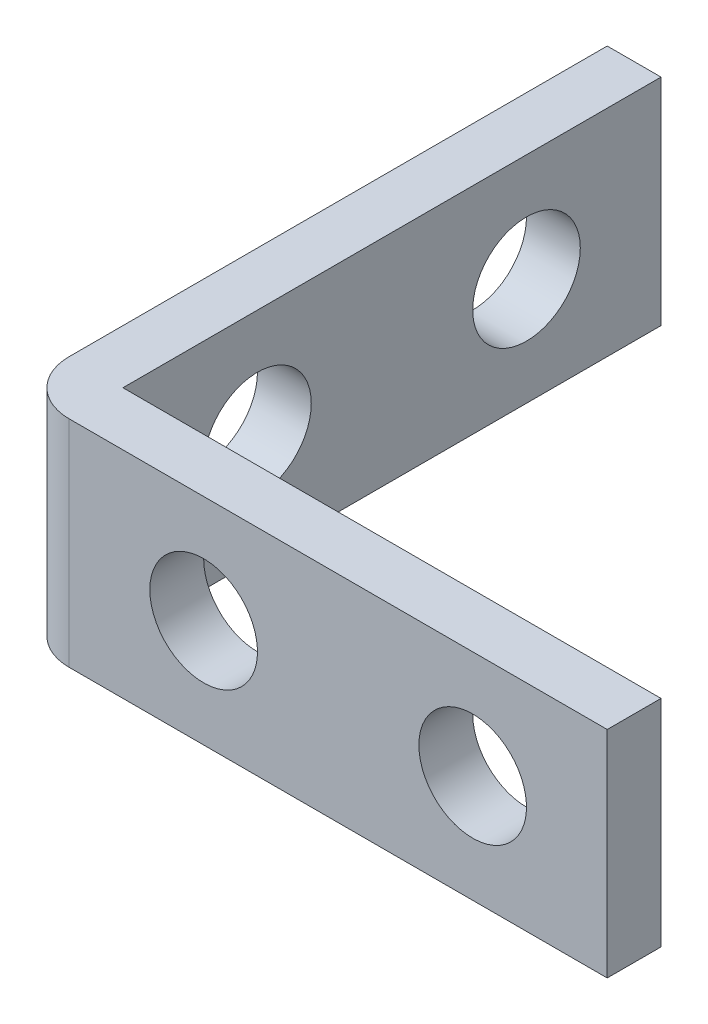
ISO-10303-21;
HEADER;
FILE_DESCRIPTION(('STEP AP214'),'2;1');
FILE_NAME('part.step','',(''),(''),'','','');
FILE_SCHEMA(('AUTOMOTIVE_DESIGN { 1 0 10303 214 1 1 1 1 }'));
ENDSEC;
DATA;
#1=APPLICATION_CONTEXT('core data for automotive mechanical design processes');
#2=APPLICATION_PROTOCOL_DEFINITION('international standard','automotive_design',2000,#1);
#3=PRODUCT_CONTEXT('',#1,'mechanical');
#4=PRODUCT('Part','Part','',(#3));
#5=PRODUCT_RELATED_PRODUCT_CATEGORY('part','',(#4));
#6=PRODUCT_DEFINITION_FORMATION('','',#4);
#7=PRODUCT_DEFINITION_CONTEXT('part definition',#1,'design');
#8=PRODUCT_DEFINITION('design','',#6,#7);
#9=PRODUCT_DEFINITION_SHAPE('','',#8);
#10=(LENGTH_UNIT() NAMED_UNIT(*) SI_UNIT(.MILLI.,.METRE.));
#11=(NAMED_UNIT(*) PLANE_ANGLE_UNIT() SI_UNIT($,.RADIAN.));
#12=(NAMED_UNIT(*) SI_UNIT($,.STERADIAN.) SOLID_ANGLE_UNIT());
#13=UNCERTAINTY_MEASURE_WITH_UNIT(LENGTH_MEASURE(1.E-05),#10,'distance_accuracy_value','');
#14=(GEOMETRIC_REPRESENTATION_CONTEXT(3) GLOBAL_UNCERTAINTY_ASSIGNED_CONTEXT((#13)) GLOBAL_UNIT_ASSIGNED_CONTEXT((#10,
#11,#12)) REPRESENTATION_CONTEXT('',''));
#15=CARTESIAN_POINT('',(0.,0.,0.));
#16=DIRECTION('',(0.,0.,1.));
#17=DIRECTION('',(1.,0.,0.));
#18=AXIS2_PLACEMENT_3D('',#15,#16,#17);
#19=CARTESIAN_POINT('',(-2.,8.,-20.));
#20=DIRECTION('',(0.,0.,1.));
#21=DIRECTION('',(1.,0.,0.));
#22=AXIS2_PLACEMENT_3D('',#19,#20,#21);
#23=PLANE('',#22);
#24=DIRECTION('',(-1.,0.,0.));
#25=VECTOR('',#24,1.);
#26=CARTESIAN_POINT('',(-2.,0.,-20.));
#27=LINE('',#26,#25);
#28=CARTESIAN_POINT('',(0.,0.,-20.));
#29=VERTEX_POINT('',#28);
#30=CARTESIAN_POINT('',(-2.,0.,-20.));
#31=VERTEX_POINT('',#30);
#32=EDGE_CURVE('E109',#29,#31,#27,.T.);
#33=ORIENTED_EDGE('',*,*,#32,.T.);
#34=DIRECTION('',(0.,-1.,0.));
#35=VECTOR('',#34,1.);
#36=CARTESIAN_POINT('',(-2.,8.,-20.));
#37=LINE('',#36,#35);
#38=CARTESIAN_POINT('',(-2.,8.,-20.));
#39=VERTEX_POINT('',#38);
#40=EDGE_CURVE('E92',#39,#31,#37,.T.);
#41=ORIENTED_EDGE('',*,*,#40,.F.);
#42=DIRECTION('',(-1.,0.,0.));
#43=VECTOR('',#42,1.);
#44=CARTESIAN_POINT('',(-2.,8.,-20.));
#45=LINE('',#44,#43);
#46=CARTESIAN_POINT('',(0.,8.,-20.));
#47=VERTEX_POINT('',#46);
#48=EDGE_CURVE('E97',#47,#39,#45,.T.);
#49=ORIENTED_EDGE('',*,*,#48,.F.);
#50=DIRECTION('',(0.,-1.,0.));
#51=VECTOR('',#50,1.);
#52=CARTESIAN_POINT('',(0.,8.,-20.));
#53=LINE('',#52,#51);
#54=EDGE_CURVE('E125',#47,#29,#53,.T.);
#55=ORIENTED_EDGE('',*,*,#54,.T.);
#56=EDGE_LOOP('',(#33,#41,#49,#55));
#57=FACE_BOUND('',#56,.T.);
#58=ADVANCED_FACE('F33',(#57),#23,.F.);
#59=CARTESIAN_POINT('',(-2.,8.,2.));
#60=DIRECTION('',(1.,0.,0.));
#61=DIRECTION('',(0.,0.,-1.));
#62=AXIS2_PLACEMENT_3D('',#59,#60,#61);
#63=PLANE('',#62);
#64=CARTESIAN_POINT('',(-2.,4.,-15.));
#65=DIRECTION('',(1.,0.,0.));
#66=DIRECTION('',(0.,0.,-1.));
#67=AXIS2_PLACEMENT_3D('',#64,#65,#66);
#68=CIRCLE('',#67,2.00000000000001);
#69=CARTESIAN_POINT('',(-2.,4.,-17.));
#70=VERTEX_POINT('',#69);
#71=EDGE_CURVE('E161',#70,#70,#68,.T.);
#72=ORIENTED_EDGE('',*,*,#71,.T.);
#73=EDGE_LOOP('',(#72));
#74=FACE_BOUND('',#73,.T.);
#75=CARTESIAN_POINT('',(-2.,4.,-5.));
#76=DIRECTION('',(1.,0.,0.));
#77=DIRECTION('',(0.,0.,-1.));
#78=AXIS2_PLACEMENT_3D('',#75,#76,#77);
#79=CIRCLE('',#78,2.);
#80=CARTESIAN_POINT('',(-2.,4.,-7.));
#81=VERTEX_POINT('',#80);
#82=EDGE_CURVE('E155',#81,#81,#79,.T.);
#83=ORIENTED_EDGE('',*,*,#82,.T.);
#84=EDGE_LOOP('',(#83));
#85=FACE_BOUND('',#84,.T.);
#86=DIRECTION('',(0.,0.,1.));
#87=VECTOR('',#86,1.);
#88=CARTESIAN_POINT('',(-2.,0.,2.));
#89=LINE('',#88,#87);
#90=CARTESIAN_POINT('',(-2.,0.,0.));
#91=VERTEX_POINT('',#90);
#92=EDGE_CURVE('E134',#31,#91,#89,.T.);
#93=ORIENTED_EDGE('',*,*,#92,.T.);
#94=DIRECTION('',(0.,-1.,0.));
#95=VECTOR('',#94,1.);
#96=CARTESIAN_POINT('',(-2.,8.,0.));
#97=LINE('',#96,#95);
#98=CARTESIAN_POINT('',(-2.,8.,0.));
#99=VERTEX_POINT('',#98);
#100=EDGE_CURVE('E41',#91,#99,#97,.F.);
#101=ORIENTED_EDGE('',*,*,#100,.T.);
#102=DIRECTION('',(0.,0.,1.));
#103=VECTOR('',#102,1.);
#104=CARTESIAN_POINT('',(-2.,8.,2.));
#105=LINE('',#104,#103);
#106=EDGE_CURVE('E88',#39,#99,#105,.T.);
#107=ORIENTED_EDGE('',*,*,#106,.F.);
#108=ORIENTED_EDGE('',*,*,#40,.T.);
#109=EDGE_LOOP('',(#93,#101,#107,#108));
#110=FACE_BOUND('',#109,.T.);
#111=ADVANCED_FACE('F90',(#74,#85,#110),#63,.F.);
#112=CARTESIAN_POINT('',(20.,8.,2.));
#113=DIRECTION('',(0.,0.,-1.));
#114=DIRECTION('',(-1.,0.,0.));
#115=AXIS2_PLACEMENT_3D('',#112,#113,#114);
#116=PLANE('',#115);
#117=CARTESIAN_POINT('',(5.,4.,2.));
#118=DIRECTION('',(0.,0.,-1.));
#119=DIRECTION('',(-1.,0.,0.));
#120=AXIS2_PLACEMENT_3D('',#117,#118,#119);
#121=CIRCLE('',#120,2.);
#122=CARTESIAN_POINT('',(3.,4.,2.));
#123=VERTEX_POINT('',#122);
#124=EDGE_CURVE('E149',#123,#123,#121,.T.);
#125=ORIENTED_EDGE('',*,*,#124,.T.);
#126=EDGE_LOOP('',(#125));
#127=FACE_BOUND('',#126,.T.);
#128=CARTESIAN_POINT('',(15.,4.,2.));
#129=DIRECTION('',(0.,0.,-1.));
#130=DIRECTION('',(-1.,0.,0.));
#131=AXIS2_PLACEMENT_3D('',#128,#129,#130);
#132=CIRCLE('',#131,2.);
#133=CARTESIAN_POINT('',(13.,4.,2.));
#134=VERTEX_POINT('',#133);
#135=EDGE_CURVE('E137',#134,#134,#132,.T.);
#136=ORIENTED_EDGE('',*,*,#135,.T.);
#137=EDGE_LOOP('',(#136));
#138=FACE_BOUND('',#137,.T.);
#139=DIRECTION('',(1.,0.,0.));
#140=VECTOR('',#139,1.);
#141=CARTESIAN_POINT('',(20.,8.,2.));
#142=LINE('',#141,#140);
#143=CARTESIAN_POINT('',(0.,8.,2.));
#144=VERTEX_POINT('',#143);
#145=CARTESIAN_POINT('',(20.,8.,2.));
#146=VERTEX_POINT('',#145);
#147=EDGE_CURVE('E96',#144,#146,#142,.T.);
#148=ORIENTED_EDGE('',*,*,#147,.F.);
#149=DIRECTION('',(0.,-1.,0.));
#150=VECTOR('',#149,1.);
#151=CARTESIAN_POINT('',(0.,8.,2.));
#152=LINE('',#151,#150);
#153=CARTESIAN_POINT('',(0.,0.,2.));
#154=VERTEX_POINT('',#153);
#155=EDGE_CURVE('E110',#144,#154,#152,.T.);
#156=ORIENTED_EDGE('',*,*,#155,.T.);
#157=DIRECTION('',(1.,0.,0.));
#158=VECTOR('',#157,1.);
#159=CARTESIAN_POINT('',(20.,0.,2.));
#160=LINE('',#159,#158);
#161=CARTESIAN_POINT('',(20.,0.,2.));
#162=VERTEX_POINT('',#161);
#163=EDGE_CURVE('E132',#154,#162,#160,.T.);
#164=ORIENTED_EDGE('',*,*,#163,.T.);
#165=DIRECTION('',(0.,-1.,0.));
#166=VECTOR('',#165,1.);
#167=CARTESIAN_POINT('',(20.,8.,2.));
#168=LINE('',#167,#166);
#169=EDGE_CURVE('E111',#146,#162,#168,.T.);
#170=ORIENTED_EDGE('',*,*,#169,.F.);
#171=EDGE_LOOP('',(#148,#156,#164,#170));
#172=FACE_BOUND('',#171,.T.);
#173=ADVANCED_FACE('F187',(#127,#138,#172),#116,.F.);
#174=CARTESIAN_POINT('',(20.,8.,0.));
#175=DIRECTION('',(-1.,0.,0.));
#176=DIRECTION('',(0.,0.,1.));
#177=AXIS2_PLACEMENT_3D('',#174,#175,#176);
#178=PLANE('',#177);
#179=DIRECTION('',(0.,0.,-1.));
#180=VECTOR('',#179,1.);
#181=CARTESIAN_POINT('',(20.,0.,0.));
#182=LINE('',#181,#180);
#183=CARTESIAN_POINT('',(20.,0.,0.));
#184=VERTEX_POINT('',#183);
#185=EDGE_CURVE('E130',#162,#184,#182,.T.);
#186=ORIENTED_EDGE('',*,*,#185,.T.);
#187=DIRECTION('',(0.,-1.,0.));
#188=VECTOR('',#187,1.);
#189=CARTESIAN_POINT('',(20.,8.,0.));
#190=LINE('',#189,#188);
#191=CARTESIAN_POINT('',(20.,8.,0.));
#192=VERTEX_POINT('',#191);
#193=EDGE_CURVE('E116',#192,#184,#190,.T.);
#194=ORIENTED_EDGE('',*,*,#193,.F.);
#195=DIRECTION('',(0.,0.,-1.));
#196=VECTOR('',#195,1.);
#197=CARTESIAN_POINT('',(20.,8.,0.));
#198=LINE('',#197,#196);
#199=EDGE_CURVE('E141',#146,#192,#198,.T.);
#200=ORIENTED_EDGE('',*,*,#199,.F.);
#201=ORIENTED_EDGE('',*,*,#169,.T.);
#202=EDGE_LOOP('',(#186,#194,#200,#201));
#203=FACE_BOUND('',#202,.T.);
#204=ADVANCED_FACE('F192',(#203),#178,.F.);
#205=CARTESIAN_POINT('',(0.,8.,0.));
#206=DIRECTION('',(0.,0.,1.));
#207=DIRECTION('',(1.,0.,0.));
#208=AXIS2_PLACEMENT_3D('',#205,#206,#207);
#209=PLANE('',#208);
#210=CARTESIAN_POINT('',(5.,4.,0.));
#211=DIRECTION('',(0.,0.,-1.));
#212=DIRECTION('',(-1.,0.,0.));
#213=AXIS2_PLACEMENT_3D('',#210,#211,#212);
#214=CIRCLE('',#213,2.);
#215=CARTESIAN_POINT('',(3.,4.,0.));
#216=VERTEX_POINT('',#215);
#217=EDGE_CURVE('E152',#216,#216,#214,.T.);
#218=ORIENTED_EDGE('',*,*,#217,.F.);
#219=EDGE_LOOP('',(#218));
#220=FACE_BOUND('',#219,.T.);
#221=CARTESIAN_POINT('',(15.,4.,0.));
#222=DIRECTION('',(0.,0.,-1.));
#223=DIRECTION('',(-1.,0.,0.));
#224=AXIS2_PLACEMENT_3D('',#221,#222,#223);
#225=CIRCLE('',#224,2.);
#226=CARTESIAN_POINT('',(13.,4.,0.));
#227=VERTEX_POINT('',#226);
#228=EDGE_CURVE('E146',#227,#227,#225,.T.);
#229=ORIENTED_EDGE('',*,*,#228,.F.);
#230=EDGE_LOOP('',(#229));
#231=FACE_BOUND('',#230,.T.);
#232=DIRECTION('',(-1.,0.,0.));
#233=VECTOR('',#232,1.);
#234=CARTESIAN_POINT('',(0.,0.,0.));
#235=LINE('',#234,#233);
#236=CARTESIAN_POINT('',(0.,0.,0.));
#237=VERTEX_POINT('',#236);
#238=EDGE_CURVE('E128',#184,#237,#235,.T.);
#239=ORIENTED_EDGE('',*,*,#238,.T.);
#240=DIRECTION('',(0.,-1.,0.));
#241=VECTOR('',#240,1.);
#242=CARTESIAN_POINT('',(0.,8.,0.));
#243=LINE('',#242,#241);
#244=CARTESIAN_POINT('',(0.,8.,0.));
#245=VERTEX_POINT('',#244);
#246=EDGE_CURVE('E122',#245,#237,#243,.T.);
#247=ORIENTED_EDGE('',*,*,#246,.F.);
#248=DIRECTION('',(-1.,0.,0.));
#249=VECTOR('',#248,1.);
#250=CARTESIAN_POINT('',(0.,8.,0.));
#251=LINE('',#250,#249);
#252=EDGE_CURVE('E139',#192,#245,#251,.T.);
#253=ORIENTED_EDGE('',*,*,#252,.F.);
#254=ORIENTED_EDGE('',*,*,#193,.T.);
#255=EDGE_LOOP('',(#239,#247,#253,#254));
#256=FACE_BOUND('',#255,.T.);
#257=ADVANCED_FACE('F174',(#220,#231,#256),#209,.F.);
#258=CARTESIAN_POINT('',(0.,8.,-20.));
#259=DIRECTION('',(-1.,0.,0.));
#260=DIRECTION('',(0.,0.,1.));
#261=AXIS2_PLACEMENT_3D('',#258,#259,#260);
#262=PLANE('',#261);
#263=CARTESIAN_POINT('',(0.,4.,-15.));
#264=DIRECTION('',(1.,0.,0.));
#265=DIRECTION('',(0.,0.,-1.));
#266=AXIS2_PLACEMENT_3D('',#263,#264,#265);
#267=CIRCLE('',#266,2.00000000000001);
#268=CARTESIAN_POINT('',(0.,4.,-17.));
#269=VERTEX_POINT('',#268);
#270=EDGE_CURVE('E164',#269,#269,#267,.T.);
#271=ORIENTED_EDGE('',*,*,#270,.F.);
#272=EDGE_LOOP('',(#271));
#273=FACE_BOUND('',#272,.T.);
#274=CARTESIAN_POINT('',(0.,4.,-5.));
#275=DIRECTION('',(1.,0.,0.));
#276=DIRECTION('',(0.,0.,-1.));
#277=AXIS2_PLACEMENT_3D('',#274,#275,#276);
#278=CIRCLE('',#277,2.);
#279=CARTESIAN_POINT('',(0.,4.,-7.));
#280=VERTEX_POINT('',#279);
#281=EDGE_CURVE('E158',#280,#280,#278,.T.);
#282=ORIENTED_EDGE('',*,*,#281,.F.);
#283=EDGE_LOOP('',(#282));
#284=FACE_BOUND('',#283,.T.);
#285=DIRECTION('',(0.,0.,-1.));
#286=VECTOR('',#285,1.);
#287=CARTESIAN_POINT('',(0.,0.,-20.));
#288=LINE('',#287,#286);
#289=EDGE_CURVE('E106',#237,#29,#288,.T.);
#290=ORIENTED_EDGE('',*,*,#289,.T.);
#291=ORIENTED_EDGE('',*,*,#54,.F.);
#292=DIRECTION('',(0.,0.,-1.));
#293=VECTOR('',#292,1.);
#294=CARTESIAN_POINT('',(0.,8.,-20.));
#295=LINE('',#294,#293);
#296=EDGE_CURVE('E102',#245,#47,#295,.T.);
#297=ORIENTED_EDGE('',*,*,#296,.F.);
#298=ORIENTED_EDGE('',*,*,#246,.T.);
#299=EDGE_LOOP('',(#290,#291,#297,#298));
#300=FACE_BOUND('',#299,.T.);
#301=ADVANCED_FACE('F171',(#273,#284,#300),#262,.F.);
#302=CARTESIAN_POINT('',(0.,8.,0.));
#303=DIRECTION('',(0.,-1.,0.));
#304=DIRECTION('',(0.,0.,-1.));
#305=AXIS2_PLACEMENT_3D('',#302,#303,#304);
#306=PLANE('',#305);
#307=ORIENTED_EDGE('',*,*,#106,.T.);
#308=CARTESIAN_POINT('',(0.,8.,0.));
#309=DIRECTION('',(0.,-1.,0.));
#310=DIRECTION('',(0.,0.,-1.));
#311=AXIS2_PLACEMENT_3D('',#308,#309,#310);
#312=CIRCLE('',#311,2.);
#313=EDGE_CURVE('E11',#99,#144,#312,.F.);
#314=ORIENTED_EDGE('',*,*,#313,.T.);
#315=ORIENTED_EDGE('',*,*,#147,.T.);
#316=ORIENTED_EDGE('',*,*,#199,.T.);
#317=ORIENTED_EDGE('',*,*,#252,.T.);
#318=ORIENTED_EDGE('',*,*,#296,.T.);
#319=ORIENTED_EDGE('',*,*,#48,.T.);
#320=EDGE_LOOP('',(#307,#314,#315,#316,#317,#318,#319));
#321=FACE_BOUND('',#320,.T.);
#322=ADVANCED_FACE('F100',(#321),#306,.F.);
#323=CARTESIAN_POINT('',(0.,0.,0.));
#324=DIRECTION('',(0.,-1.,0.));
#325=DIRECTION('',(0.,0.,-1.));
#326=AXIS2_PLACEMENT_3D('',#323,#324,#325);
#327=PLANE('',#326);
#328=ORIENTED_EDGE('',*,*,#163,.F.);
#329=CARTESIAN_POINT('',(0.,0.,0.));
#330=DIRECTION('',(0.,-1.,0.));
#331=DIRECTION('',(0.,0.,-1.));
#332=AXIS2_PLACEMENT_3D('',#329,#330,#331);
#333=CIRCLE('',#332,2.);
#334=EDGE_CURVE('E55',#154,#91,#333,.T.);
#335=ORIENTED_EDGE('',*,*,#334,.T.);
#336=ORIENTED_EDGE('',*,*,#92,.F.);
#337=ORIENTED_EDGE('',*,*,#32,.F.);
#338=ORIENTED_EDGE('',*,*,#289,.F.);
#339=ORIENTED_EDGE('',*,*,#238,.F.);
#340=ORIENTED_EDGE('',*,*,#185,.F.);
#341=EDGE_LOOP('',(#328,#335,#336,#337,#338,#339,#340));
#342=FACE_BOUND('',#341,.T.);
#343=ADVANCED_FACE('F181',(#342),#327,.T.);
#344=CARTESIAN_POINT('',(15.,4.,8.));
#345=DIRECTION('',(0.,0.,-1.));
#346=DIRECTION('',(-1.,0.,0.));
#347=AXIS2_PLACEMENT_3D('',#344,#345,#346);
#348=CYLINDRICAL_SURFACE('',#347,2.);
#349=ORIENTED_EDGE('',*,*,#228,.T.);
#350=EDGE_LOOP('',(#349));
#351=FACE_BOUND('',#350,.T.);
#352=ORIENTED_EDGE('',*,*,#135,.F.);
#353=EDGE_LOOP('',(#352));
#354=FACE_BOUND('',#353,.T.);
#355=ADVANCED_FACE('F219',(#351,#354),#348,.F.);
#356=CARTESIAN_POINT('',(5.,4.,8.));
#357=DIRECTION('',(0.,0.,-1.));
#358=DIRECTION('',(-1.,0.,0.));
#359=AXIS2_PLACEMENT_3D('',#356,#357,#358);
#360=CYLINDRICAL_SURFACE('',#359,2.);
#361=ORIENTED_EDGE('',*,*,#217,.T.);
#362=EDGE_LOOP('',(#361));
#363=FACE_BOUND('',#362,.T.);
#364=ORIENTED_EDGE('',*,*,#124,.F.);
#365=EDGE_LOOP('',(#364));
#366=FACE_BOUND('',#365,.T.);
#367=ADVANCED_FACE('F221',(#363,#366),#360,.F.);
#368=CARTESIAN_POINT('',(-8.,4.,-5.));
#369=DIRECTION('',(1.,0.,0.));
#370=DIRECTION('',(0.,0.,-1.));
#371=AXIS2_PLACEMENT_3D('',#368,#369,#370);
#372=CYLINDRICAL_SURFACE('',#371,2.);
#373=ORIENTED_EDGE('',*,*,#281,.T.);
#374=EDGE_LOOP('',(#373));
#375=FACE_BOUND('',#374,.T.);
#376=ORIENTED_EDGE('',*,*,#82,.F.);
#377=EDGE_LOOP('',(#376));
#378=FACE_BOUND('',#377,.T.);
#379=ADVANCED_FACE('F228',(#375,#378),#372,.F.);
#380=CARTESIAN_POINT('',(-8.,4.,-15.));
#381=DIRECTION('',(1.,0.,0.));
#382=DIRECTION('',(0.,0.,-1.));
#383=AXIS2_PLACEMENT_3D('',#380,#381,#382);
#384=CYLINDRICAL_SURFACE('',#383,2.00000000000001);
#385=ORIENTED_EDGE('',*,*,#270,.T.);
#386=EDGE_LOOP('',(#385));
#387=FACE_BOUND('',#386,.T.);
#388=ORIENTED_EDGE('',*,*,#71,.F.);
#389=EDGE_LOOP('',(#388));
#390=FACE_BOUND('',#389,.T.);
#391=ADVANCED_FACE('F168',(#387,#390),#384,.F.);
#392=CARTESIAN_POINT('',(0.,8.,0.));
#393=DIRECTION('',(0.,-1.,0.));
#394=DIRECTION('',(0.,0.,-1.));
#395=AXIS2_PLACEMENT_3D('',#392,#393,#394);
#396=CYLINDRICAL_SURFACE('',#395,2.);
#397=ORIENTED_EDGE('',*,*,#313,.F.);
#398=ORIENTED_EDGE('',*,*,#100,.F.);
#399=ORIENTED_EDGE('',*,*,#334,.F.);
#400=ORIENTED_EDGE('',*,*,#155,.F.);
#401=EDGE_LOOP('',(#397,#398,#399,#400));
#402=FACE_BOUND('',#401,.T.);
#403=ADVANCED_FACE('F35',(#402),#396,.T.);
#404=CLOSED_SHELL('',(#58,#111,#173,#204,#257,#301,#322,#343,#355,#367,#379,#391,#403));
#405=MANIFOLD_SOLID_BREP('B2',#404);
#406=ADVANCED_BREP_SHAPE_REPRESENTATION('',(#18,#405),#14);
#407=SHAPE_DEFINITION_REPRESENTATION(#9,#406);
ENDSEC;
END-ISO-10303-21;
